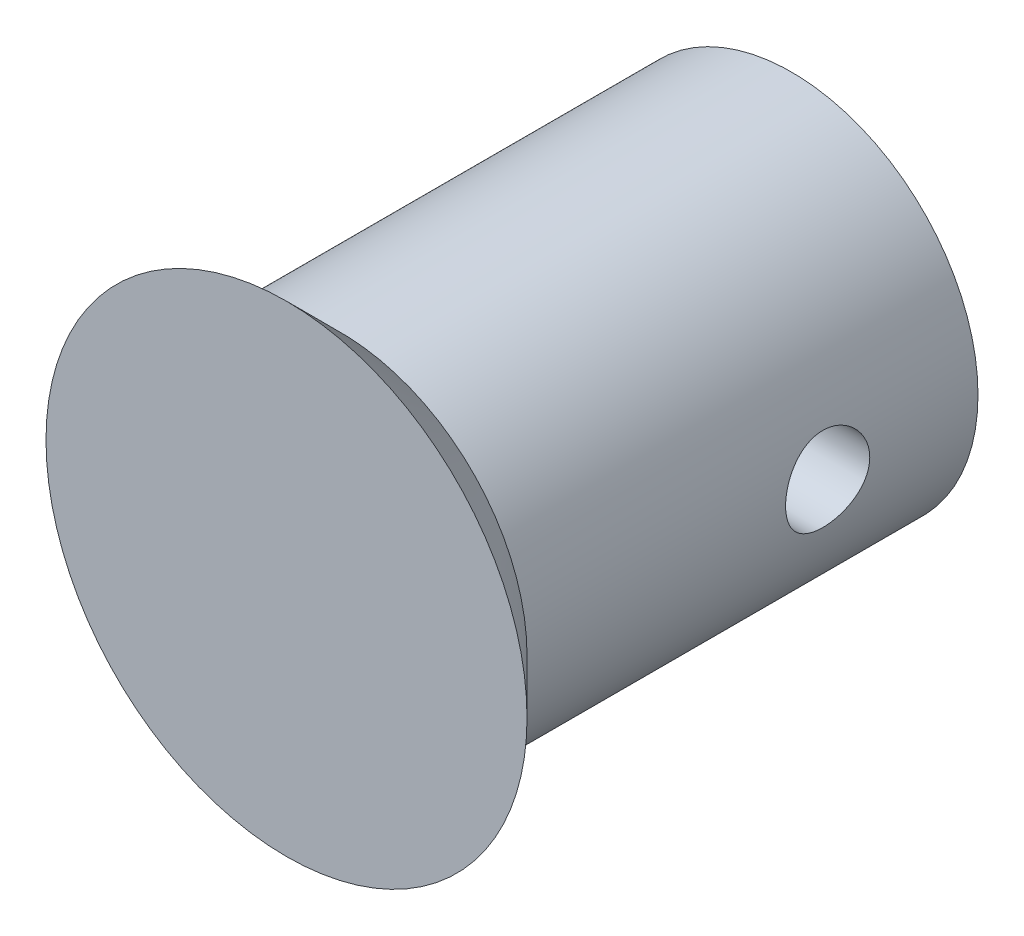
ISO-10303-21;
HEADER;
FILE_DESCRIPTION(('STEP AP214'),'2;1');
FILE_NAME('part.step','',(''),(''),'','','');
FILE_SCHEMA(('AUTOMOTIVE_DESIGN { 1 0 10303 214 1 1 1 1 }'));
ENDSEC;
DATA;
#1=APPLICATION_CONTEXT('core data for automotive mechanical design processes');
#2=APPLICATION_PROTOCOL_DEFINITION('international standard','automotive_design',2000,#1);
#3=PRODUCT_CONTEXT('',#1,'mechanical');
#4=PRODUCT('Part','Part','',(#3));
#5=PRODUCT_RELATED_PRODUCT_CATEGORY('part','',(#4));
#6=PRODUCT_DEFINITION_FORMATION('','',#4);
#7=PRODUCT_DEFINITION_CONTEXT('part definition',#1,'design');
#8=PRODUCT_DEFINITION('design','',#6,#7);
#9=PRODUCT_DEFINITION_SHAPE('','',#8);
#10=(LENGTH_UNIT() NAMED_UNIT(*) SI_UNIT(.MILLI.,.METRE.));
#11=(NAMED_UNIT(*) PLANE_ANGLE_UNIT() SI_UNIT($,.RADIAN.));
#12=(NAMED_UNIT(*) SI_UNIT($,.STERADIAN.) SOLID_ANGLE_UNIT());
#13=UNCERTAINTY_MEASURE_WITH_UNIT(LENGTH_MEASURE(1.E-05),#10,'distance_accuracy_value','');
#14=(GEOMETRIC_REPRESENTATION_CONTEXT(3) GLOBAL_UNCERTAINTY_ASSIGNED_CONTEXT((#13)) GLOBAL_UNIT_ASSIGNED_CONTEXT((#10,
#11,#12)) REPRESENTATION_CONTEXT('',''));
#15=CARTESIAN_POINT('',(0.,0.,0.));
#16=DIRECTION('',(0.,0.,1.));
#17=DIRECTION('',(1.,0.,0.));
#18=AXIS2_PLACEMENT_3D('',#15,#16,#17);
#19=CARTESIAN_POINT('',(0.,0.,0.));
#20=DIRECTION('',(0.,0.,-1.));
#21=DIRECTION('',(-1.,0.,0.));
#22=AXIS2_PLACEMENT_3D('',#19,#20,#21);
#23=PLANE('',#22);
#24=CARTESIAN_POINT('',(0.,0.,0.));
#25=DIRECTION('',(0.,0.,1.));
#26=DIRECTION('',(1.,0.,0.));
#27=AXIS2_PLACEMENT_3D('',#24,#25,#26);
#28=CIRCLE('',#27,10.0000000000002);
#29=CARTESIAN_POINT('',(10.0000000000002,0.,0.));
#30=VERTEX_POINT('',#29);
#31=EDGE_CURVE('E10',#30,#30,#28,.T.);
#32=ORIENTED_EDGE('',*,*,#31,.T.);
#33=EDGE_LOOP('',(#32));
#34=FACE_BOUND('',#33,.T.);
#35=ADVANCED_FACE('F33',(#34),#23,.F.);
#36=CARTESIAN_POINT('',(0.,0.,-2.25000000000009));
#37=DIRECTION('',(0.,0.,1.));
#38=DIRECTION('',(1.,0.,0.));
#39=AXIS2_PLACEMENT_3D('',#36,#37,#38);
#40=CONICAL_SURFACE('',#39,7.75000000000016,0.785398163397428);
#41=ORIENTED_EDGE('',*,*,#31,.F.);
#42=EDGE_LOOP('',(#41));
#43=FACE_BOUND('',#42,.T.);
#44=CARTESIAN_POINT('',(0.,0.,-2.25000000000009));
#45=DIRECTION('',(0.,0.,1.));
#46=DIRECTION('',(1.,0.,0.));
#47=AXIS2_PLACEMENT_3D('',#44,#45,#46);
#48=CIRCLE('',#47,7.75000000000016);
#49=CARTESIAN_POINT('',(7.75000000000016,0.,-2.25000000000009));
#50=VERTEX_POINT('',#49);
#51=EDGE_CURVE('E45',#50,#50,#48,.T.);
#52=ORIENTED_EDGE('',*,*,#51,.T.);
#53=EDGE_LOOP('',(#52));
#54=FACE_BOUND('',#53,.T.);
#55=ADVANCED_FACE('F72',(#43,#54),#40,.T.);
#56=CARTESIAN_POINT('',(0.,0.,1000.));
#57=DIRECTION('',(0.,0.,1.));
#58=DIRECTION('',(1.,0.,0.));
#59=AXIS2_PLACEMENT_3D('',#56,#57,#58);
#60=CYLINDRICAL_SURFACE('',#59,7.75000000000016);
#61=CARTESIAN_POINT('',(7.75000000000016,0.,-16.5));
#62=CARTESIAN_POINT('',(7.74999822671761,-0.0969796476026719,-16.4999968022177));
#63=CARTESIAN_POINT('',(7.7481612459754,-0.193997266309187,-16.491911326212));
#64=CARTESIAN_POINT('',(7.74101070918773,-0.385271385263797,-16.4598198110505));
#65=CARTESIAN_POINT('',(7.73569477986965,-0.479525954719662,-16.4358029036225));
#66=CARTESIAN_POINT('',(7.72217754138033,-0.662482495672789,-16.3726433649588));
#67=CARTESIAN_POINT('',(7.71397934565219,-0.751190337477723,-16.3335170505338));
#68=CARTESIAN_POINT('',(7.69557984847038,-0.920780189462086,-16.2413023843245));
#69=CARTESIAN_POINT('',(7.68537857248973,-1.00166229914117,-16.1882142100893));
#70=CARTESIAN_POINT('',(7.66389398420815,-1.15468498237631,-16.068626110137));
#71=CARTESIAN_POINT('',(7.65259652492359,-1.22667317022782,-16.0019337205525));
#72=CARTESIAN_POINT('',(7.63029128702912,-1.35854251379533,-15.8574432877499));
#73=CARTESIAN_POINT('',(7.6192835357118,-1.41842253235991,-15.7796442026045));
#74=CARTESIAN_POINT('',(7.59866393889804,-1.5250576041982,-15.6140099317139));
#75=CARTESIAN_POINT('',(7.5890701873188,-1.57164865933987,-15.526066709805));
#76=CARTESIAN_POINT('',(7.5725686357833,-1.64933072751488,-15.343346226564));
#77=CARTESIAN_POINT('',(7.56566049187829,-1.6804237255455,-15.2485698422069));
#78=CARTESIAN_POINT('',(7.55545670928359,-1.72571992373907,-15.056531488809));
#79=CARTESIAN_POINT('',(7.5521032346289,-1.74019385782227,-14.9593365179481));
#80=CARTESIAN_POINT('',(7.54921491319913,-1.75268321389195,-14.7638444905683));
#81=CARTESIAN_POINT('',(7.54967956495004,-1.75070079726073,-14.6655475804718));
#82=CARTESIAN_POINT('',(7.55432271435471,-1.73055119227381,-14.4726677803151));
#83=CARTESIAN_POINT('',(7.55842864848818,-1.71270021629149,-14.3780498432097));
#84=CARTESIAN_POINT('',(7.5697768059324,-1.66182193449187,-14.1931874023284));
#85=CARTESIAN_POINT('',(7.57701921553873,-1.62879372719339,-14.1029431586886));
#86=CARTESIAN_POINT('',(7.59389472733994,-1.54821274235725,-13.928509748764));
#87=CARTESIAN_POINT('',(7.6035474698943,-1.50053986059039,-13.8443780449961));
#88=CARTESIAN_POINT('',(7.62414419341026,-1.39210712941816,-13.6851922069521));
#89=CARTESIAN_POINT('',(7.63508836119309,-1.33134538548864,-13.6101393892416));
#90=CARTESIAN_POINT('',(7.65734490825795,-1.19679358195814,-13.4694229995928));
#91=CARTESIAN_POINT('',(7.66865995420343,-1.12273505796513,-13.4040162843669));
#92=CARTESIAN_POINT('',(7.69015367161448,-0.964570384279474,-13.2865076095273));
#93=CARTESIAN_POINT('',(7.70033231977916,-0.880464028637518,-13.2344059226941));
#94=CARTESIAN_POINT('',(7.71844291737926,-0.704266289994044,-13.1449162882916));
#95=CARTESIAN_POINT('',(7.726369450923,-0.612156342384378,-13.1075637268583));
#96=CARTESIAN_POINT('',(7.73904270262657,-0.422747965298704,-13.0489391406394));
#97=CARTESIAN_POINT('',(7.74378991431905,-0.325450343648799,-13.0276646199606));
#98=CARTESIAN_POINT('',(7.74949878862485,-0.130630211827249,-13.0021776204782));
#99=CARTESIAN_POINT('',(7.75053823230026,-0.0331557882151229,-12.9976145163812));
#100=CARTESIAN_POINT('',(7.74893318546256,0.161162702813037,-13.0047270912079));
#101=CARTESIAN_POINT('',(7.74628896216897,0.258006815440923,-13.0164015922278));
#102=CARTESIAN_POINT('',(7.73766294506637,0.447141684235398,-13.0553675454632));
#103=CARTESIAN_POINT('',(7.73172081554022,0.539472627184737,-13.08247349984));
#104=CARTESIAN_POINT('',(7.71716482038428,0.718276398247828,-13.1513257424864));
#105=CARTESIAN_POINT('',(7.70855071711139,0.804748704465554,-13.1930733330139));
#106=CARTESIAN_POINT('',(7.68941545295311,0.970818702768305,-13.2907432398287));
#107=CARTESIAN_POINT('',(7.67886753599166,1.05029331134956,-13.3468694766473));
#108=CARTESIAN_POINT('',(7.65708635975918,1.19882165064805,-13.47143667647));
#109=CARTESIAN_POINT('',(7.64585300534943,1.26787393010469,-13.539879351577));
#110=CARTESIAN_POINT('',(7.62369585757754,1.39499660395274,-13.6887501146816));
#111=CARTESIAN_POINT('',(7.61278254433312,1.45282345216514,-13.7693880275299));
#112=CARTESIAN_POINT('',(7.59275301967772,1.55411655685976,-13.93943588334));
#113=CARTESIAN_POINT('',(7.58363672907135,1.59758344624727,-14.0288454394724));
#114=CARTESIAN_POINT('',(7.56832396682331,1.66862031501804,-14.2134131946979));
#115=CARTESIAN_POINT('',(7.56211076334472,1.69628160071936,-14.3085347940534));
#116=CARTESIAN_POINT('',(7.55327999007847,1.73518490863127,-14.5022354935291));
#117=CARTESIAN_POINT('',(7.55066180140315,1.74642975697944,-14.6008139955407));
#118=CARTESIAN_POINT('',(7.54935830350839,1.75205461903664,-14.7961700582982));
#119=CARTESIAN_POINT('',(7.55058280085683,1.74682138746911,-14.892936079278));
#120=CARTESIAN_POINT('',(7.55662174306824,1.72050768484741,-15.0841688402982));
#121=CARTESIAN_POINT('',(7.56143613972256,1.69942742660243,-15.1786356111975));
#122=CARTESIAN_POINT('',(7.57406704669975,1.64221040134247,-15.3622566764037));
#123=CARTESIAN_POINT('',(7.58187162295297,1.60613343946646,-15.4514304819826));
#124=CARTESIAN_POINT('',(7.59960745883194,1.51999721956558,-15.6225158650228));
#125=CARTESIAN_POINT('',(7.60953895656771,1.46993639584852,-15.7044266279294));
#126=CARTESIAN_POINT('',(7.6306764004251,1.35598592997386,-15.8605593822703));
#127=CARTESIAN_POINT('',(7.64190515063079,1.29182218766629,-15.9345782775514));
#128=CARTESIAN_POINT('',(7.66422257891296,1.15203826709724,-16.0709248811301));
#129=CARTESIAN_POINT('',(7.67531122387139,1.0764154330643,-16.1332498717217));
#130=CARTESIAN_POINT('',(7.69628383638434,0.914580897242998,-16.2452802228139));
#131=CARTESIAN_POINT('',(7.70614872419387,0.828235544878361,-16.2947963051908));
#132=CARTESIAN_POINT('',(7.72336907307909,0.648240190311245,-16.3785330860019));
#133=CARTESIAN_POINT('',(7.73072657301584,0.55459619944028,-16.4127662186924));
#134=CARTESIAN_POINT('',(7.740838034995,0.384091866870255,-16.459080247851));
#135=CARTESIAN_POINT('',(7.74425200532746,0.308132439933623,-16.4743950720759));
#136=CARTESIAN_POINT('',(7.74883363930541,0.154790024691338,-16.494855969837));
#137=CARTESIAN_POINT('',(7.75000141539686,0.0774071078423323,-16.5000025524024));
#138=CARTESIAN_POINT('',(7.75000000000016,0.,-16.5));
#139=B_SPLINE_CURVE_WITH_KNOTS('',3,(#61,#62,#63,#64,#65,#66,#67,#68,#69,#70,#71,#72,#73,#74,
#75,#76,#77,#78,#79,#80,#81,#82,#83,#84,#85,#86,#87,#88,#89,#90,#91,#92,#93,#94,#95,#96,#97,#98,
#99,#100,#101,#102,#103,#104,#105,#106,#107,#108,#109,#110,#111,#112,#113,#114,#115,#116,#117,
#118,#119,#120,#121,#122,#123,#124,#125,#126,#127,#128,#129,#130,#131,#132,#133,#134,#135,#136,
#137,#138),.UNSPECIFIED.,.T.,.F.,(4,2,2,2,2,2,2,2,2,2,2,2,2,2,2,2,2,2,2,2,2,2,2,2,2,2,2,2,2,2,2,
2,2,2,2,2,2,2,4),(0.,0.290655533373658,0.581509553405526,0.872050351479833,1.16258745501029,
1.4575621726084,1.75256458021273,2.05106395881054,2.3495250956596,2.64305189016116,
2.9365401333706,3.22430796349292,3.51209288835504,3.80230403068287,4.09255720736718,
4.38951334050749,4.68647556136986,4.98414598754698,5.28177019501524,5.57311291435598,
5.86443450029654,6.1523259659157,6.44024304370411,6.7324943175381,7.02478624852695,
7.32284495869009,7.62089053036789,7.91719646822144,8.2134513901259,8.50280522591992,
8.79215517606065,9.08036213640871,9.3686013785671,9.66303581846932,9.95753860148028,
10.2561723691062,10.5545627225696,10.7865694493802,11.0185645614784),.UNSPECIFIED.);
#140=CARTESIAN_POINT('',(7.75000000000016,0.,-16.5));
#141=VERTEX_POINT('',#140);
#142=EDGE_CURVE('E36',#141,#141,#139,.T.);
#143=ORIENTED_EDGE('',*,*,#142,.T.);
#144=EDGE_LOOP('',(#143));
#145=FACE_BOUND('',#144,.T.);
#146=CARTESIAN_POINT('',(-7.75000000000016,0.,-16.5));
#147=CARTESIAN_POINT('',(-7.74999822671761,0.0969796476026765,-16.4999968022177));
#148=CARTESIAN_POINT('',(-7.7481612459754,0.193997266309194,-16.491911326212));
#149=CARTESIAN_POINT('',(-7.74101070918773,0.385271385263803,-16.4598198110505));
#150=CARTESIAN_POINT('',(-7.73569477986965,0.479525954719666,-16.4358029036225));
#151=CARTESIAN_POINT('',(-7.72217754138033,0.662482495672791,-16.3726433649588));
#152=CARTESIAN_POINT('',(-7.71397934565219,0.751190337477725,-16.3335170505338));
#153=CARTESIAN_POINT('',(-7.69557984847038,0.920780189462088,-16.2413023843245));
#154=CARTESIAN_POINT('',(-7.68537857248973,1.00166229914118,-16.1882142100893));
#155=CARTESIAN_POINT('',(-7.66389398420815,1.15468498237631,-16.068626110137));
#156=CARTESIAN_POINT('',(-7.65259652492359,1.22667317022783,-16.0019337205524));
#157=CARTESIAN_POINT('',(-7.63029128702912,1.35854251379534,-15.8574432877499));
#158=CARTESIAN_POINT('',(-7.6192835357118,1.41842253235991,-15.7796442026045));
#159=CARTESIAN_POINT('',(-7.59866393889804,1.52505760419821,-15.6140099317139));
#160=CARTESIAN_POINT('',(-7.5890701873188,1.57164865933987,-15.526066709805));
#161=CARTESIAN_POINT('',(-7.5725686357833,1.64933072751488,-15.343346226564));
#162=CARTESIAN_POINT('',(-7.56566049187828,1.68042372554551,-15.2485698422069));
#163=CARTESIAN_POINT('',(-7.55545670928359,1.72571992373907,-15.056531488809));
#164=CARTESIAN_POINT('',(-7.5521032346289,1.74019385782228,-14.9593365179481));
#165=CARTESIAN_POINT('',(-7.54921491319913,1.75268321389195,-14.7638444905683));
#166=CARTESIAN_POINT('',(-7.54967956495004,1.75070079726074,-14.6655475804718));
#167=CARTESIAN_POINT('',(-7.55432271435471,1.73055119227382,-14.4726677803151));
#168=CARTESIAN_POINT('',(-7.55842864848818,1.7127002162915,-14.3780498432097));
#169=CARTESIAN_POINT('',(-7.56977680593239,1.66182193449187,-14.1931874023284));
#170=CARTESIAN_POINT('',(-7.57701921553872,1.62879372719339,-14.1029431586886));
#171=CARTESIAN_POINT('',(-7.59389472733994,1.54821274235726,-13.928509748764));
#172=CARTESIAN_POINT('',(-7.6035474698943,1.5005398605904,-13.8443780449961));
#173=CARTESIAN_POINT('',(-7.62414419341026,1.39210712941817,-13.6851922069521));
#174=CARTESIAN_POINT('',(-7.63508836119309,1.33134538548865,-13.6101393892416));
#175=CARTESIAN_POINT('',(-7.65734490825795,1.19679358195815,-13.4694229995928));
#176=CARTESIAN_POINT('',(-7.66865995420343,1.12273505796514,-13.4040162843669));
#177=CARTESIAN_POINT('',(-7.69015367161448,0.96457038427948,-13.2865076095273));
#178=CARTESIAN_POINT('',(-7.70033231977916,0.880464028637524,-13.2344059226941));
#179=CARTESIAN_POINT('',(-7.71844291737926,0.704266289994049,-13.1449162882916));
#180=CARTESIAN_POINT('',(-7.726369450923,0.612156342384383,-13.1075637268583));
#181=CARTESIAN_POINT('',(-7.73904270262657,0.42274796529871,-13.0489391406394));
#182=CARTESIAN_POINT('',(-7.74378991431905,0.325450343648805,-13.0276646199606));
#183=CARTESIAN_POINT('',(-7.74949878862485,0.130630211827256,-13.0021776204782));
#184=CARTESIAN_POINT('',(-7.75053823230026,0.0331557882151293,-12.9976145163812));
#185=CARTESIAN_POINT('',(-7.74893318546256,-0.161162702813031,-13.0047270912079));
#186=CARTESIAN_POINT('',(-7.74628896216897,-0.258006815440917,-13.0164015922278));
#187=CARTESIAN_POINT('',(-7.73766294506637,-0.447141684235392,-13.0553675454632));
#188=CARTESIAN_POINT('',(-7.73172081554022,-0.539472627184731,-13.08247349984));
#189=CARTESIAN_POINT('',(-7.71716482038428,-0.718276398247822,-13.1513257424864));
#190=CARTESIAN_POINT('',(-7.70855071711139,-0.804748704465548,-13.1930733330139));
#191=CARTESIAN_POINT('',(-7.68941545295312,-0.9708187027683,-13.2907432398287));
#192=CARTESIAN_POINT('',(-7.67886753599166,-1.05029331134955,-13.3468694766473));
#193=CARTESIAN_POINT('',(-7.65708635975918,-1.19882165064805,-13.47143667647));
#194=CARTESIAN_POINT('',(-7.64585300534944,-1.26787393010468,-13.539879351577));
#195=CARTESIAN_POINT('',(-7.62369585757755,-1.39499660395273,-13.6887501146816));
#196=CARTESIAN_POINT('',(-7.61278254433312,-1.45282345216513,-13.7693880275298));
#197=CARTESIAN_POINT('',(-7.59275301967772,-1.55411655685975,-13.93943588334));
#198=CARTESIAN_POINT('',(-7.58363672907135,-1.59758344624726,-14.0288454394724));
#199=CARTESIAN_POINT('',(-7.56832396682331,-1.66862031501803,-14.2134131946979));
#200=CARTESIAN_POINT('',(-7.56211076334472,-1.69628160071935,-14.3085347940534));
#201=CARTESIAN_POINT('',(-7.55327999007848,-1.73518490863126,-14.5022354935291));
#202=CARTESIAN_POINT('',(-7.55066180140315,-1.74642975697943,-14.6008139955407));
#203=CARTESIAN_POINT('',(-7.54935830350839,-1.75205461903664,-14.7961700582982));
#204=CARTESIAN_POINT('',(-7.55058280085683,-1.7468213874691,-14.892936079278));
#205=CARTESIAN_POINT('',(-7.55662174306824,-1.72050768484741,-15.0841688402982));
#206=CARTESIAN_POINT('',(-7.56143613972256,-1.69942742660242,-15.1786356111975));
#207=CARTESIAN_POINT('',(-7.57406704669975,-1.64221040134246,-15.3622566764037));
#208=CARTESIAN_POINT('',(-7.58187162295297,-1.60613343946646,-15.4514304819826));
#209=CARTESIAN_POINT('',(-7.59960745883194,-1.51999721956557,-15.6225158650228));
#210=CARTESIAN_POINT('',(-7.60953895656772,-1.46993639584852,-15.7044266279294));
#211=CARTESIAN_POINT('',(-7.6306764004251,-1.35598592997386,-15.8605593822703));
#212=CARTESIAN_POINT('',(-7.64190515063079,-1.29182218766628,-15.9345782775514));
#213=CARTESIAN_POINT('',(-7.66422257891296,-1.15203826709723,-16.0709248811301));
#214=CARTESIAN_POINT('',(-7.67531122387139,-1.0764154330643,-16.1332498717217));
#215=CARTESIAN_POINT('',(-7.69628383638434,-0.914580897242996,-16.2452802228139));
#216=CARTESIAN_POINT('',(-7.70614872419387,-0.828235544878358,-16.2947963051908));
#217=CARTESIAN_POINT('',(-7.72336907307909,-0.648240190311241,-16.3785330860019));
#218=CARTESIAN_POINT('',(-7.73072657301584,-0.554596199440276,-16.4127662186924));
#219=CARTESIAN_POINT('',(-7.740838034995,-0.384091866870253,-16.459080247851));
#220=CARTESIAN_POINT('',(-7.74425200532746,-0.308132439933623,-16.4743950720759));
#221=CARTESIAN_POINT('',(-7.74883363930541,-0.154790024691338,-16.494855969837));
#222=CARTESIAN_POINT('',(-7.75000141539686,-0.0774071078423311,-16.5000025524024));
#223=CARTESIAN_POINT('',(-7.75000000000016,0.,-16.5));
#224=B_SPLINE_CURVE_WITH_KNOTS('',3,(#146,#147,#148,#149,#150,#151,#152,#153,#154,#155,#156,
#157,#158,#159,#160,#161,#162,#163,#164,#165,#166,#167,#168,#169,#170,#171,#172,#173,#174,#175,
#176,#177,#178,#179,#180,#181,#182,#183,#184,#185,#186,#187,#188,#189,#190,#191,#192,#193,#194,
#195,#196,#197,#198,#199,#200,#201,#202,#203,#204,#205,#206,#207,#208,#209,#210,#211,#212,#213,
#214,#215,#216,#217,#218,#219,#220,#221,#222,#223),.UNSPECIFIED.,.T.,.F.,(4,2,2,2,2,2,2,2,2,2,2,
2,2,2,2,2,2,2,2,2,2,2,2,2,2,2,2,2,2,2,2,2,2,2,2,2,2,2,4),(0.,0.29065553337366,0.581509553405523,
0.872050351479828,1.16258745501029,1.4575621726084,1.75256458021273,2.05106395881054,
2.3495250956596,2.64305189016116,2.93654013337059,3.22430796349291,3.51209288835504,
3.80230403068287,4.09255720736717,4.38951334050749,4.68647556136986,4.98414598754698,
5.28177019501524,5.57311291435598,5.86443450029654,6.1523259659157,6.44024304370411,
6.7324943175381,7.02478624852695,7.32284495869009,7.6208905303679,7.91719646822145,
8.2134513901259,8.50280522591992,8.79215517606066,9.08036213640871,9.3686013785671,
9.66303581846932,9.95753860148028,10.2561723691062,10.5545627225696,10.7865694493802,
11.0185645614784),.UNSPECIFIED.);
#225=CARTESIAN_POINT('',(-7.75000000000016,0.,-16.5));
#226=VERTEX_POINT('',#225);
#227=EDGE_CURVE('E53',#226,#226,#224,.T.);
#228=ORIENTED_EDGE('',*,*,#227,.T.);
#229=EDGE_LOOP('',(#228));
#230=FACE_BOUND('',#229,.T.);
#231=ORIENTED_EDGE('',*,*,#51,.F.);
#232=EDGE_LOOP('',(#231));
#233=FACE_BOUND('',#232,.T.);
#234=CARTESIAN_POINT('',(0.,0.,-20.9999999999999));
#235=DIRECTION('',(0.,0.,1.));
#236=DIRECTION('',(1.,0.,0.));
#237=AXIS2_PLACEMENT_3D('',#234,#235,#236);
#238=CIRCLE('',#237,7.75000000000016);
#239=CARTESIAN_POINT('',(7.75000000000016,0.,-20.9999999999999));
#240=VERTEX_POINT('',#239);
#241=EDGE_CURVE('E50',#240,#240,#238,.T.);
#242=ORIENTED_EDGE('',*,*,#241,.T.);
#243=EDGE_LOOP('',(#242));
#244=FACE_BOUND('',#243,.T.);
#245=ADVANCED_FACE('F58',(#145,#230,#233,#244),#60,.T.);
#246=CARTESIAN_POINT('',(0.,7.75000000000016,-21.));
#247=DIRECTION('',(0.,0.,1.));
#248=DIRECTION('',(1.,0.,0.));
#249=AXIS2_PLACEMENT_3D('',#246,#247,#248);
#250=PLANE('',#249);
#251=ORIENTED_EDGE('',*,*,#241,.F.);
#252=EDGE_LOOP('',(#251));
#253=FACE_BOUND('',#252,.T.);
#254=ADVANCED_FACE('F64',(#253),#250,.F.);
#255=CARTESIAN_POINT('',(-10.0000000000002,0.,-14.75));
#256=DIRECTION('',(1.,0.,0.));
#257=DIRECTION('',(0.,0.,-1.));
#258=AXIS2_PLACEMENT_3D('',#255,#256,#257);
#259=CYLINDRICAL_SURFACE('',#258,1.75);
#260=ORIENTED_EDGE('',*,*,#227,.F.);
#261=EDGE_LOOP('',(#260));
#262=FACE_BOUND('',#261,.T.);
#263=ORIENTED_EDGE('',*,*,#142,.F.);
#264=EDGE_LOOP('',(#263));
#265=FACE_BOUND('',#264,.T.);
#266=ADVANCED_FACE('F61',(#262,#265),#259,.F.);
#267=CLOSED_SHELL('',(#35,#55,#245,#254,#266));
#268=MANIFOLD_SOLID_BREP('B2',#267);
#269=ADVANCED_BREP_SHAPE_REPRESENTATION('',(#18,#268),#14);
#270=SHAPE_DEFINITION_REPRESENTATION(#9,#269);
ENDSEC;
END-ISO-10303-21;
